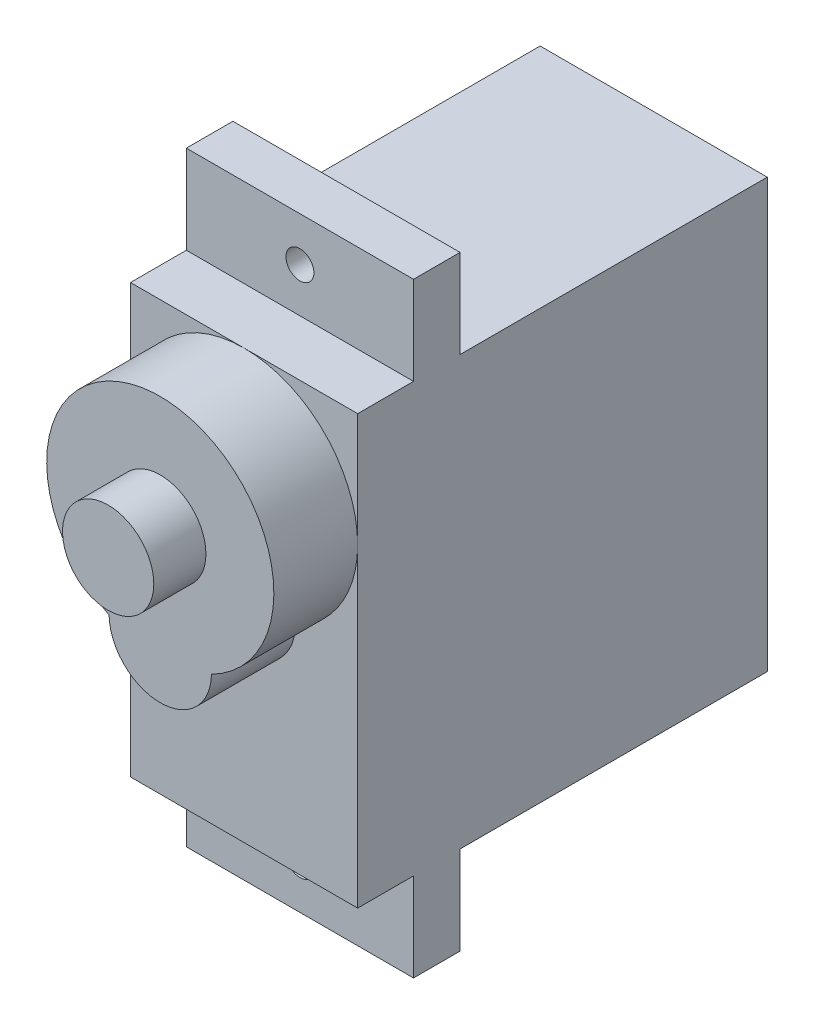
ISO-10303-21;
HEADER;
FILE_DESCRIPTION(('STEP AP214'),'2;1');
FILE_NAME('part.step','',(''),(''),'','','');
FILE_SCHEMA(('AUTOMOTIVE_DESIGN { 1 0 10303 214 1 1 1 1 }'));
ENDSEC;
DATA;
#1=APPLICATION_CONTEXT('core data for automotive mechanical design processes');
#2=APPLICATION_PROTOCOL_DEFINITION('international standard','automotive_design',2000,#1);
#3=PRODUCT_CONTEXT('',#1,'mechanical');
#4=PRODUCT('Part','Part','',(#3));
#5=PRODUCT_RELATED_PRODUCT_CATEGORY('part','',(#4));
#6=PRODUCT_DEFINITION_FORMATION('','',#4);
#7=PRODUCT_DEFINITION_CONTEXT('part definition',#1,'design');
#8=PRODUCT_DEFINITION('design','',#6,#7);
#9=PRODUCT_DEFINITION_SHAPE('','',#8);
#10=(LENGTH_UNIT() NAMED_UNIT(*) SI_UNIT(.MILLI.,.METRE.));
#11=(NAMED_UNIT(*) PLANE_ANGLE_UNIT() SI_UNIT($,.RADIAN.));
#12=(NAMED_UNIT(*) SI_UNIT($,.STERADIAN.) SOLID_ANGLE_UNIT());
#13=UNCERTAINTY_MEASURE_WITH_UNIT(LENGTH_MEASURE(1.E-05),#10,'distance_accuracy_value','');
#14=(GEOMETRIC_REPRESENTATION_CONTEXT(3) GLOBAL_UNCERTAINTY_ASSIGNED_CONTEXT((#13)) GLOBAL_UNIT_ASSIGNED_CONTEXT((#10,
#11,#12)) REPRESENTATION_CONTEXT('',''));
#15=CARTESIAN_POINT('',(0.,0.,0.));
#16=DIRECTION('',(0.,0.,1.));
#17=DIRECTION('',(1.,0.,0.));
#18=AXIS2_PLACEMENT_3D('',#15,#16,#17);
#19=CARTESIAN_POINT('',(6.1,-11.5,-11.));
#20=DIRECTION('',(0.,1.,0.));
#21=DIRECTION('',(0.,0.,1.));
#22=AXIS2_PLACEMENT_3D('',#19,#20,#21);
#23=PLANE('',#22);
#24=DIRECTION('',(-1.,0.,0.));
#25=VECTOR('',#24,1.);
#26=CARTESIAN_POINT('',(6.1,-11.5,8.));
#27=LINE('',#26,#25);
#28=CARTESIAN_POINT('',(6.1,-11.5,8.));
#29=VERTEX_POINT('',#28);
#30=CARTESIAN_POINT('',(-6.1,-11.5,8.));
#31=VERTEX_POINT('',#30);
#32=EDGE_CURVE('E322',#29,#31,#27,.T.);
#33=ORIENTED_EDGE('',*,*,#32,.F.);
#34=DIRECTION('',(0.,0.,-1.));
#35=VECTOR('',#34,1.);
#36=CARTESIAN_POINT('',(6.1,-11.5,-11.));
#37=LINE('',#36,#35);
#38=CARTESIAN_POINT('',(6.1,-11.5,11.));
#39=VERTEX_POINT('',#38);
#40=EDGE_CURVE('E165',#39,#29,#37,.T.);
#41=ORIENTED_EDGE('',*,*,#40,.F.);
#42=DIRECTION('',(-1.,0.,0.));
#43=VECTOR('',#42,1.);
#44=CARTESIAN_POINT('',(6.1,-11.5,11.));
#45=LINE('',#44,#43);
#46=CARTESIAN_POINT('',(-6.1,-11.5,11.));
#47=VERTEX_POINT('',#46);
#48=EDGE_CURVE('E38',#39,#47,#45,.T.);
#49=ORIENTED_EDGE('',*,*,#48,.T.);
#50=DIRECTION('',(0.,0.,-1.));
#51=VECTOR('',#50,1.);
#52=CARTESIAN_POINT('',(-6.1,-11.5,-11.));
#53=LINE('',#52,#51);
#54=EDGE_CURVE('E238',#47,#31,#53,.T.);
#55=ORIENTED_EDGE('',*,*,#54,.T.);
#56=EDGE_LOOP('',(#33,#41,#49,#55));
#57=FACE_BOUND('',#56,.T.);
#58=ADVANCED_FACE('F34',(#57),#23,.F.);
#59=CARTESIAN_POINT('',(6.1,11.5,-11.));
#60=DIRECTION('',(0.,-1.,0.));
#61=DIRECTION('',(0.,0.,-1.));
#62=AXIS2_PLACEMENT_3D('',#59,#60,#61);
#63=PLANE('',#62);
#64=DIRECTION('',(-1.,0.,0.));
#65=VECTOR('',#64,1.);
#66=CARTESIAN_POINT('',(6.1,11.5,8.));
#67=LINE('',#66,#65);
#68=CARTESIAN_POINT('',(6.1,11.5,8.));
#69=VERTEX_POINT('',#68);
#70=CARTESIAN_POINT('',(-6.1,11.5,8.));
#71=VERTEX_POINT('',#70);
#72=EDGE_CURVE('E199',#69,#71,#67,.T.);
#73=ORIENTED_EDGE('',*,*,#72,.T.);
#74=DIRECTION('',(0.,0.,1.));
#75=VECTOR('',#74,1.);
#76=CARTESIAN_POINT('',(-6.1,11.5,-11.));
#77=LINE('',#76,#75);
#78=CARTESIAN_POINT('',(-6.1,11.5,11.));
#79=VERTEX_POINT('',#78);
#80=EDGE_CURVE('E243',#71,#79,#77,.T.);
#81=ORIENTED_EDGE('',*,*,#80,.T.);
#82=DIRECTION('',(-1.,0.,0.));
#83=VECTOR('',#82,1.);
#84=CARTESIAN_POINT('',(6.1,11.5,11.));
#85=LINE('',#84,#83);
#86=CARTESIAN_POINT('',(0.,11.5,11.));
#87=VERTEX_POINT('',#86);
#88=EDGE_CURVE('E233',#87,#79,#85,.T.);
#89=ORIENTED_EDGE('',*,*,#88,.F.);
#90=CARTESIAN_POINT('',(6.1,11.5,11.));
#91=VERTEX_POINT('',#90);
#92=EDGE_CURVE('E246',#91,#87,#85,.T.);
#93=ORIENTED_EDGE('',*,*,#92,.F.);
#94=DIRECTION('',(0.,0.,1.));
#95=VECTOR('',#94,1.);
#96=CARTESIAN_POINT('',(6.1,11.5,-11.));
#97=LINE('',#96,#95);
#98=EDGE_CURVE('E59',#69,#91,#97,.T.);
#99=ORIENTED_EDGE('',*,*,#98,.F.);
#100=EDGE_LOOP('',(#73,#81,#89,#93,#99));
#101=FACE_BOUND('',#100,.T.);
#102=ADVANCED_FACE('F276',(#101),#63,.F.);
#103=DIRECTION('',(-1.,0.,0.));
#104=VECTOR('',#103,1.);
#105=CARTESIAN_POINT('',(6.1,11.5,5.5));
#106=LINE('',#105,#104);
#107=CARTESIAN_POINT('',(6.1,11.5,5.5));
#108=VERTEX_POINT('',#107);
#109=CARTESIAN_POINT('',(-6.1,11.5,5.5));
#110=VERTEX_POINT('',#109);
#111=EDGE_CURVE('E196',#108,#110,#106,.T.);
#112=ORIENTED_EDGE('',*,*,#111,.F.);
#113=CARTESIAN_POINT('',(6.1,11.5,-11.));
#114=VERTEX_POINT('',#113);
#115=EDGE_CURVE('E230',#114,#108,#97,.T.);
#116=ORIENTED_EDGE('',*,*,#115,.F.);
#117=DIRECTION('',(-1.,0.,0.));
#118=VECTOR('',#117,1.);
#119=CARTESIAN_POINT('',(6.1,11.5,-11.));
#120=LINE('',#119,#118);
#121=CARTESIAN_POINT('',(-6.1,11.5,-11.));
#122=VERTEX_POINT('',#121);
#123=EDGE_CURVE('E249',#114,#122,#120,.T.);
#124=ORIENTED_EDGE('',*,*,#123,.T.);
#125=EDGE_CURVE('E244',#122,#110,#77,.T.);
#126=ORIENTED_EDGE('',*,*,#125,.T.);
#127=EDGE_LOOP('',(#112,#116,#124,#126));
#128=FACE_BOUND('',#127,.T.);
#129=ADVANCED_FACE('F309',(#128),#63,.F.);
#130=CARTESIAN_POINT('',(6.1,-11.5,11.));
#131=DIRECTION('',(0.,0.,-1.));
#132=DIRECTION('',(-1.,0.,0.));
#133=AXIS2_PLACEMENT_3D('',#130,#131,#132);
#134=PLANE('',#133);
#135=CARTESIAN_POINT('',(0.,0.,11.));
#136=DIRECTION('',(0.,0.,1.));
#137=DIRECTION('',(1.,0.,0.));
#138=AXIS2_PLACEMENT_3D('',#135,#136,#137);
#139=CIRCLE('',#138,2.75);
#140=CARTESIAN_POINT('',(-2.74962951699132,-0.0451388888888871,11.));
#141=VERTEX_POINT('',#140);
#142=CARTESIAN_POINT('',(2.74962951699131,-0.0451388888888906,11.));
#143=VERTEX_POINT('',#142);
#144=EDGE_CURVE('E203',#141,#143,#139,.T.);
#145=ORIENTED_EDGE('',*,*,#144,.F.);
#146=CARTESIAN_POINT('',(0.,5.4,11.));
#147=DIRECTION('',(0.,0.,1.));
#148=DIRECTION('',(1.,0.,0.));
#149=AXIS2_PLACEMENT_3D('',#146,#147,#148);
#150=CIRCLE('',#149,6.1);
#151=CARTESIAN_POINT('',(-6.1,5.4,11.));
#152=VERTEX_POINT('',#151);
#153=EDGE_CURVE('E216',#152,#141,#150,.T.);
#154=ORIENTED_EDGE('',*,*,#153,.F.);
#155=DIRECTION('',(0.,-1.,0.));
#156=VECTOR('',#155,1.);
#157=CARTESIAN_POINT('',(-6.1,-11.5,11.));
#158=LINE('',#157,#156);
#159=EDGE_CURVE('E222',#152,#47,#158,.T.);
#160=ORIENTED_EDGE('',*,*,#159,.T.);
#161=ORIENTED_EDGE('',*,*,#48,.F.);
#162=DIRECTION('',(0.,-1.,0.));
#163=VECTOR('',#162,1.);
#164=CARTESIAN_POINT('',(6.1,-11.5,11.));
#165=LINE('',#164,#163);
#166=CARTESIAN_POINT('',(6.1,5.4,11.));
#167=VERTEX_POINT('',#166);
#168=EDGE_CURVE('E226',#167,#39,#165,.T.);
#169=ORIENTED_EDGE('',*,*,#168,.F.);
#170=EDGE_CURVE('E209',#143,#167,#150,.T.);
#171=ORIENTED_EDGE('',*,*,#170,.F.);
#172=EDGE_LOOP('',(#145,#154,#160,#161,#169,#171));
#173=FACE_BOUND('',#172,.T.);
#174=ADVANCED_FACE('F272',(#173),#134,.F.);
#175=EDGE_CURVE('E43',#167,#87,#150,.T.);
#176=ORIENTED_EDGE('',*,*,#175,.F.);
#177=EDGE_CURVE('E223',#91,#167,#165,.T.);
#178=ORIENTED_EDGE('',*,*,#177,.F.);
#179=ORIENTED_EDGE('',*,*,#92,.T.);
#180=EDGE_LOOP('',(#176,#178,#179));
#181=FACE_BOUND('',#180,.T.);
#182=ADVANCED_FACE('F270',(#181),#134,.F.);
#183=EDGE_CURVE('E261',#87,#152,#150,.T.);
#184=ORIENTED_EDGE('',*,*,#183,.F.);
#185=ORIENTED_EDGE('',*,*,#88,.T.);
#186=EDGE_CURVE('E234',#79,#152,#158,.T.);
#187=ORIENTED_EDGE('',*,*,#186,.T.);
#188=EDGE_LOOP('',(#184,#185,#187));
#189=FACE_BOUND('',#188,.T.);
#190=ADVANCED_FACE('F36',(#189),#134,.F.);
#191=CARTESIAN_POINT('',(6.1,-11.5,5.5));
#192=VERTEX_POINT('',#191);
#193=CARTESIAN_POINT('',(6.1,-11.5,-11.));
#194=VERTEX_POINT('',#193);
#195=EDGE_CURVE('E225',#192,#194,#37,.T.);
#196=ORIENTED_EDGE('',*,*,#195,.F.);
#197=DIRECTION('',(-1.,0.,0.));
#198=VECTOR('',#197,1.);
#199=CARTESIAN_POINT('',(6.1,-11.5,5.5));
#200=LINE('',#199,#198);
#201=CARTESIAN_POINT('',(-6.1,-11.5,5.5));
#202=VERTEX_POINT('',#201);
#203=EDGE_CURVE('E177',#192,#202,#200,.T.);
#204=ORIENTED_EDGE('',*,*,#203,.T.);
#205=CARTESIAN_POINT('',(-6.1,-11.5,-11.));
#206=VERTEX_POINT('',#205);
#207=EDGE_CURVE('E237',#202,#206,#53,.T.);
#208=ORIENTED_EDGE('',*,*,#207,.T.);
#209=DIRECTION('',(-1.,0.,0.));
#210=VECTOR('',#209,1.);
#211=CARTESIAN_POINT('',(6.1,-11.5,-11.));
#212=LINE('',#211,#210);
#213=EDGE_CURVE('E251',#194,#206,#212,.T.);
#214=ORIENTED_EDGE('',*,*,#213,.F.);
#215=EDGE_LOOP('',(#196,#204,#208,#214));
#216=FACE_BOUND('',#215,.T.);
#217=ADVANCED_FACE('F305',(#216),#23,.F.);
#218=CARTESIAN_POINT('',(6.1,-11.5,-11.));
#219=DIRECTION('',(0.,0.,1.));
#220=DIRECTION('',(1.,0.,0.));
#221=AXIS2_PLACEMENT_3D('',#218,#219,#220);
#222=PLANE('',#221);
#223=DIRECTION('',(0.,1.,0.));
#224=VECTOR('',#223,1.);
#225=CARTESIAN_POINT('',(-6.1,-11.5,-11.));
#226=LINE('',#225,#224);
#227=EDGE_CURVE('E241',#206,#122,#226,.T.);
#228=ORIENTED_EDGE('',*,*,#227,.T.);
#229=ORIENTED_EDGE('',*,*,#123,.F.);
#230=DIRECTION('',(0.,1.,0.));
#231=VECTOR('',#230,1.);
#232=CARTESIAN_POINT('',(6.1,-11.5,-11.));
#233=LINE('',#232,#231);
#234=EDGE_CURVE('E228',#194,#114,#233,.T.);
#235=ORIENTED_EDGE('',*,*,#234,.F.);
#236=ORIENTED_EDGE('',*,*,#213,.T.);
#237=EDGE_LOOP('',(#228,#229,#235,#236));
#238=FACE_BOUND('',#237,.T.);
#239=ADVANCED_FACE('F313',(#238),#222,.F.);
#240=CARTESIAN_POINT('',(6.1,0.,0.));
#241=DIRECTION('',(1.,0.,0.));
#242=DIRECTION('',(0.,0.,-1.));
#243=AXIS2_PLACEMENT_3D('',#240,#241,#242);
#244=PLANE('',#243);
#245=ORIENTED_EDGE('',*,*,#177,.T.);
#246=ORIENTED_EDGE('',*,*,#168,.T.);
#247=ORIENTED_EDGE('',*,*,#40,.T.);
#248=DIRECTION('',(0.,-1.,0.));
#249=VECTOR('',#248,1.);
#250=CARTESIAN_POINT('',(6.1,-11.5,8.));
#251=LINE('',#250,#249);
#252=CARTESIAN_POINT('',(6.1,-16.25,8.));
#253=VERTEX_POINT('',#252);
#254=EDGE_CURVE('E159',#29,#253,#251,.T.);
#255=ORIENTED_EDGE('',*,*,#254,.T.);
#256=DIRECTION('',(0.,0.,-1.));
#257=VECTOR('',#256,1.);
#258=CARTESIAN_POINT('',(6.1,-16.25,8.));
#259=LINE('',#258,#257);
#260=CARTESIAN_POINT('',(6.1,-16.25,5.5));
#261=VERTEX_POINT('',#260);
#262=EDGE_CURVE('E149',#253,#261,#259,.T.);
#263=ORIENTED_EDGE('',*,*,#262,.T.);
#264=DIRECTION('',(0.,1.,0.));
#265=VECTOR('',#264,1.);
#266=CARTESIAN_POINT('',(6.1,-11.5,5.5));
#267=LINE('',#266,#265);
#268=EDGE_CURVE('E158',#261,#192,#267,.T.);
#269=ORIENTED_EDGE('',*,*,#268,.T.);
#270=ORIENTED_EDGE('',*,*,#195,.T.);
#271=ORIENTED_EDGE('',*,*,#234,.T.);
#272=ORIENTED_EDGE('',*,*,#115,.T.);
#273=DIRECTION('',(0.,1.,0.));
#274=VECTOR('',#273,1.);
#275=CARTESIAN_POINT('',(6.1,11.5,5.5));
#276=LINE('',#275,#274);
#277=CARTESIAN_POINT('',(6.1,16.25,5.5));
#278=VERTEX_POINT('',#277);
#279=EDGE_CURVE('E183',#108,#278,#276,.T.);
#280=ORIENTED_EDGE('',*,*,#279,.T.);
#281=DIRECTION('',(0.,0.,1.));
#282=VECTOR('',#281,1.);
#283=CARTESIAN_POINT('',(6.1,16.25,8.));
#284=LINE('',#283,#282);
#285=CARTESIAN_POINT('',(6.1,16.25,8.));
#286=VERTEX_POINT('',#285);
#287=EDGE_CURVE('E186',#278,#286,#284,.T.);
#288=ORIENTED_EDGE('',*,*,#287,.T.);
#289=DIRECTION('',(0.,-1.,0.));
#290=VECTOR('',#289,1.);
#291=CARTESIAN_POINT('',(6.1,11.5,8.));
#292=LINE('',#291,#290);
#293=EDGE_CURVE('E181',#286,#69,#292,.T.);
#294=ORIENTED_EDGE('',*,*,#293,.T.);
#295=ORIENTED_EDGE('',*,*,#98,.T.);
#296=EDGE_LOOP('',(#245,#246,#247,#255,#263,#269,#270,#271,#272,#280,#288,#294,#295));
#297=FACE_BOUND('',#296,.T.);
#298=ADVANCED_FACE('F163',(#297),#244,.T.);
#299=CARTESIAN_POINT('',(-6.1,0.,0.));
#300=DIRECTION('',(1.,0.,0.));
#301=DIRECTION('',(0.,0.,-1.));
#302=AXIS2_PLACEMENT_3D('',#299,#300,#301);
#303=PLANE('',#302);
#304=ORIENTED_EDGE('',*,*,#186,.F.);
#305=ORIENTED_EDGE('',*,*,#80,.F.);
#306=DIRECTION('',(0.,-1.,0.));
#307=VECTOR('',#306,1.);
#308=CARTESIAN_POINT('',(-6.1,11.5,8.));
#309=LINE('',#308,#307);
#310=CARTESIAN_POINT('',(-6.1,16.25,8.));
#311=VERTEX_POINT('',#310);
#312=EDGE_CURVE('E172',#311,#71,#309,.T.);
#313=ORIENTED_EDGE('',*,*,#312,.F.);
#314=DIRECTION('',(0.,0.,1.));
#315=VECTOR('',#314,1.);
#316=CARTESIAN_POINT('',(-6.1,16.25,8.));
#317=LINE('',#316,#315);
#318=CARTESIAN_POINT('',(-6.1,16.25,5.5));
#319=VERTEX_POINT('',#318);
#320=EDGE_CURVE('E184',#319,#311,#317,.T.);
#321=ORIENTED_EDGE('',*,*,#320,.F.);
#322=DIRECTION('',(0.,1.,0.));
#323=VECTOR('',#322,1.);
#324=CARTESIAN_POINT('',(-6.1,11.5,5.5));
#325=LINE('',#324,#323);
#326=EDGE_CURVE('E175',#110,#319,#325,.T.);
#327=ORIENTED_EDGE('',*,*,#326,.F.);
#328=ORIENTED_EDGE('',*,*,#125,.F.);
#329=ORIENTED_EDGE('',*,*,#227,.F.);
#330=ORIENTED_EDGE('',*,*,#207,.F.);
#331=DIRECTION('',(0.,1.,0.));
#332=VECTOR('',#331,1.);
#333=CARTESIAN_POINT('',(-6.1,-11.5,5.5));
#334=LINE('',#333,#332);
#335=CARTESIAN_POINT('',(-6.1,-16.25,5.5));
#336=VERTEX_POINT('',#335);
#337=EDGE_CURVE('E51',#336,#202,#334,.T.);
#338=ORIENTED_EDGE('',*,*,#337,.F.);
#339=DIRECTION('',(0.,0.,-1.));
#340=VECTOR('',#339,1.);
#341=CARTESIAN_POINT('',(-6.1,-16.25,8.));
#342=LINE('',#341,#340);
#343=CARTESIAN_POINT('',(-6.1,-16.25,8.));
#344=VERTEX_POINT('',#343);
#345=EDGE_CURVE('E328',#344,#336,#342,.T.);
#346=ORIENTED_EDGE('',*,*,#345,.F.);
#347=DIRECTION('',(0.,-1.,0.));
#348=VECTOR('',#347,1.);
#349=CARTESIAN_POINT('',(-6.1,-11.5,8.));
#350=LINE('',#349,#348);
#351=EDGE_CURVE('E171',#31,#344,#350,.T.);
#352=ORIENTED_EDGE('',*,*,#351,.F.);
#353=ORIENTED_EDGE('',*,*,#54,.F.);
#354=ORIENTED_EDGE('',*,*,#159,.F.);
#355=EDGE_LOOP('',(#304,#305,#313,#321,#327,#328,#329,#330,#338,#346,#352,#353,#354));
#356=FACE_BOUND('',#355,.T.);
#357=ADVANCED_FACE('F282',(#356),#303,.F.);
#358=CARTESIAN_POINT('',(0.,0.,15.5));
#359=DIRECTION('',(0.,0.,-1.));
#360=DIRECTION('',(-1.,0.,0.));
#361=AXIS2_PLACEMENT_3D('',#358,#359,#360);
#362=CYLINDRICAL_SURFACE('',#361,2.75);
#363=ORIENTED_EDGE('',*,*,#144,.T.);
#364=DIRECTION('',(0.,0.,-1.));
#365=VECTOR('',#364,1.);
#366=CARTESIAN_POINT('',(2.74962951699131,-0.0451388888888906,15.5));
#367=LINE('',#366,#365);
#368=CARTESIAN_POINT('',(2.74962951699131,-0.0451388888888906,15.5));
#369=VERTEX_POINT('',#368);
#370=EDGE_CURVE('E219',#369,#143,#367,.T.);
#371=ORIENTED_EDGE('',*,*,#370,.F.);
#372=CARTESIAN_POINT('',(0.,0.,15.5));
#373=DIRECTION('',(0.,0.,1.));
#374=DIRECTION('',(1.,0.,0.));
#375=AXIS2_PLACEMENT_3D('',#372,#373,#374);
#376=CIRCLE('',#375,2.75);
#377=CARTESIAN_POINT('',(-2.74962951699132,-0.0451388888888871,15.5));
#378=VERTEX_POINT('',#377);
#379=EDGE_CURVE('E205',#378,#369,#376,.T.);
#380=ORIENTED_EDGE('',*,*,#379,.F.);
#381=DIRECTION('',(0.,0.,-1.));
#382=VECTOR('',#381,1.);
#383=CARTESIAN_POINT('',(-2.74962951699132,-0.0451388888888871,15.5));
#384=LINE('',#383,#382);
#385=EDGE_CURVE('E211',#378,#141,#384,.T.);
#386=ORIENTED_EDGE('',*,*,#385,.T.);
#387=EDGE_LOOP('',(#363,#371,#380,#386));
#388=FACE_BOUND('',#387,.T.);
#389=ADVANCED_FACE('F287',(#388),#362,.T.);
#390=CARTESIAN_POINT('',(0.,5.4,15.5));
#391=DIRECTION('',(0.,0.,-1.));
#392=DIRECTION('',(-1.,0.,0.));
#393=AXIS2_PLACEMENT_3D('',#390,#391,#392);
#394=CYLINDRICAL_SURFACE('',#393,6.1);
#395=ORIENTED_EDGE('',*,*,#170,.T.);
#396=ORIENTED_EDGE('',*,*,#175,.T.);
#397=ORIENTED_EDGE('',*,*,#183,.T.);
#398=ORIENTED_EDGE('',*,*,#153,.T.);
#399=ORIENTED_EDGE('',*,*,#385,.F.);
#400=CARTESIAN_POINT('',(0.,5.4,15.5));
#401=DIRECTION('',(0.,0.,1.));
#402=DIRECTION('',(1.,0.,0.));
#403=AXIS2_PLACEMENT_3D('',#400,#401,#402);
#404=CIRCLE('',#403,6.1);
#405=EDGE_CURVE('E208',#369,#378,#404,.T.);
#406=ORIENTED_EDGE('',*,*,#405,.F.);
#407=ORIENTED_EDGE('',*,*,#370,.T.);
#408=EDGE_LOOP('',(#395,#396,#397,#398,#399,#406,#407));
#409=FACE_BOUND('',#408,.T.);
#410=ADVANCED_FACE('F266',(#409),#394,.T.);
#411=CARTESIAN_POINT('',(0.,2.7,15.5));
#412=DIRECTION('',(0.,0.,1.));
#413=DIRECTION('',(1.,0.,0.));
#414=AXIS2_PLACEMENT_3D('',#411,#412,#413);
#415=PLANE('',#414);
#416=CARTESIAN_POINT('',(0.,5.4,15.5));
#417=DIRECTION('',(0.,0.,1.));
#418=DIRECTION('',(1.,0.,0.));
#419=AXIS2_PLACEMENT_3D('',#416,#417,#418);
#420=CIRCLE('',#419,2.45);
#421=CARTESIAN_POINT('',(2.45,5.4,15.5));
#422=VERTEX_POINT('',#421);
#423=EDGE_CURVE('E11',#422,#422,#420,.T.);
#424=ORIENTED_EDGE('',*,*,#423,.F.);
#425=EDGE_LOOP('',(#424));
#426=FACE_BOUND('',#425,.T.);
#427=ORIENTED_EDGE('',*,*,#379,.T.);
#428=ORIENTED_EDGE('',*,*,#405,.T.);
#429=EDGE_LOOP('',(#427,#428));
#430=FACE_BOUND('',#429,.T.);
#431=ADVANCED_FACE('F290',(#426,#430),#415,.T.);
#432=CARTESIAN_POINT('',(0.,5.4,18.3));
#433=DIRECTION('',(0.,0.,-1.));
#434=DIRECTION('',(-1.,0.,0.));
#435=AXIS2_PLACEMENT_3D('',#432,#433,#434);
#436=CYLINDRICAL_SURFACE('',#435,2.45);
#437=CARTESIAN_POINT('',(0.,5.4,18.3));
#438=DIRECTION('',(0.,0.,1.));
#439=DIRECTION('',(1.,0.,0.));
#440=AXIS2_PLACEMENT_3D('',#437,#438,#439);
#441=CIRCLE('',#440,2.45);
#442=CARTESIAN_POINT('',(2.45,5.4,18.3));
#443=VERTEX_POINT('',#442);
#444=EDGE_CURVE('E201',#443,#443,#441,.T.);
#445=ORIENTED_EDGE('',*,*,#444,.F.);
#446=EDGE_LOOP('',(#445));
#447=FACE_BOUND('',#446,.T.);
#448=ORIENTED_EDGE('',*,*,#423,.T.);
#449=EDGE_LOOP('',(#448));
#450=FACE_BOUND('',#449,.T.);
#451=ADVANCED_FACE('F292',(#447,#450),#436,.T.);
#452=CARTESIAN_POINT('',(0.,5.4,18.3));
#453=DIRECTION('',(0.,0.,1.));
#454=DIRECTION('',(1.,0.,0.));
#455=AXIS2_PLACEMENT_3D('',#452,#453,#454);
#456=PLANE('',#455);
#457=ORIENTED_EDGE('',*,*,#444,.T.);
#458=EDGE_LOOP('',(#457));
#459=FACE_BOUND('',#458,.T.);
#460=ADVANCED_FACE('F299',(#459),#456,.T.);
#461=CARTESIAN_POINT('',(6.1,11.5,8.));
#462=DIRECTION('',(0.,0.,-1.));
#463=DIRECTION('',(-1.,0.,0.));
#464=AXIS2_PLACEMENT_3D('',#461,#462,#463);
#465=PLANE('',#464);
#466=CARTESIAN_POINT('',(0.,13.875,8.));
#467=DIRECTION('',(0.,0.,1.));
#468=DIRECTION('',(1.,0.,0.));
#469=AXIS2_PLACEMENT_3D('',#466,#467,#468);
#470=CIRCLE('',#469,0.75);
#471=CARTESIAN_POINT('',(0.75,13.875,8.));
#472=VERTEX_POINT('',#471);
#473=EDGE_CURVE('E335',#472,#472,#470,.T.);
#474=ORIENTED_EDGE('',*,*,#473,.F.);
#475=EDGE_LOOP('',(#474));
#476=FACE_BOUND('',#475,.T.);
#477=ORIENTED_EDGE('',*,*,#312,.T.);
#478=ORIENTED_EDGE('',*,*,#72,.F.);
#479=ORIENTED_EDGE('',*,*,#293,.F.);
#480=DIRECTION('',(-1.,0.,0.));
#481=VECTOR('',#480,1.);
#482=CARTESIAN_POINT('',(6.1,16.25,8.));
#483=LINE('',#482,#481);
#484=EDGE_CURVE('E187',#286,#311,#483,.T.);
#485=ORIENTED_EDGE('',*,*,#484,.T.);
#486=EDGE_LOOP('',(#477,#478,#479,#485));
#487=FACE_BOUND('',#486,.T.);
#488=ADVANCED_FACE('F347',(#476,#487),#465,.F.);
#489=CARTESIAN_POINT('',(6.1,11.5,5.5));
#490=DIRECTION('',(0.,0.,1.));
#491=DIRECTION('',(1.,0.,0.));
#492=AXIS2_PLACEMENT_3D('',#489,#490,#491);
#493=PLANE('',#492);
#494=CARTESIAN_POINT('',(0.,13.875,5.5));
#495=DIRECTION('',(0.,0.,1.));
#496=DIRECTION('',(1.,0.,0.));
#497=AXIS2_PLACEMENT_3D('',#494,#495,#496);
#498=CIRCLE('',#497,0.75);
#499=CARTESIAN_POINT('',(0.75,13.875,5.5));
#500=VERTEX_POINT('',#499);
#501=EDGE_CURVE('E330',#500,#500,#498,.F.);
#502=ORIENTED_EDGE('',*,*,#501,.F.);
#503=EDGE_LOOP('',(#502));
#504=FACE_BOUND('',#503,.T.);
#505=ORIENTED_EDGE('',*,*,#326,.T.);
#506=DIRECTION('',(-1.,0.,0.));
#507=VECTOR('',#506,1.);
#508=CARTESIAN_POINT('',(6.1,16.25,5.5));
#509=LINE('',#508,#507);
#510=EDGE_CURVE('E193',#278,#319,#509,.T.);
#511=ORIENTED_EDGE('',*,*,#510,.F.);
#512=ORIENTED_EDGE('',*,*,#279,.F.);
#513=ORIENTED_EDGE('',*,*,#111,.T.);
#514=EDGE_LOOP('',(#505,#511,#512,#513));
#515=FACE_BOUND('',#514,.T.);
#516=ADVANCED_FACE('F350',(#504,#515),#493,.F.);
#517=CARTESIAN_POINT('',(6.1,16.25,8.));
#518=DIRECTION('',(0.,-1.,0.));
#519=DIRECTION('',(0.,0.,-1.));
#520=AXIS2_PLACEMENT_3D('',#517,#518,#519);
#521=PLANE('',#520);
#522=ORIENTED_EDGE('',*,*,#320,.T.);
#523=ORIENTED_EDGE('',*,*,#484,.F.);
#524=ORIENTED_EDGE('',*,*,#287,.F.);
#525=ORIENTED_EDGE('',*,*,#510,.T.);
#526=EDGE_LOOP('',(#522,#523,#524,#525));
#527=FACE_BOUND('',#526,.T.);
#528=ADVANCED_FACE('F357',(#527),#521,.F.);
#529=CARTESIAN_POINT('',(6.1,-11.5,8.));
#530=DIRECTION('',(0.,0.,-1.));
#531=DIRECTION('',(-1.,0.,0.));
#532=AXIS2_PLACEMENT_3D('',#529,#530,#531);
#533=PLANE('',#532);
#534=CARTESIAN_POINT('',(0.,-13.875,8.));
#535=DIRECTION('',(0.,0.,1.));
#536=DIRECTION('',(1.,0.,0.));
#537=AXIS2_PLACEMENT_3D('',#534,#535,#536);
#538=CIRCLE('',#537,0.75);
#539=CARTESIAN_POINT('',(0.75,-13.875,8.));
#540=VERTEX_POINT('',#539);
#541=EDGE_CURVE('E336',#540,#540,#538,.T.);
#542=ORIENTED_EDGE('',*,*,#541,.F.);
#543=EDGE_LOOP('',(#542));
#544=FACE_BOUND('',#543,.T.);
#545=ORIENTED_EDGE('',*,*,#351,.T.);
#546=DIRECTION('',(-1.,0.,0.));
#547=VECTOR('',#546,1.);
#548=CARTESIAN_POINT('',(6.1,-16.25,8.));
#549=LINE('',#548,#547);
#550=EDGE_CURVE('E153',#253,#344,#549,.T.);
#551=ORIENTED_EDGE('',*,*,#550,.F.);
#552=ORIENTED_EDGE('',*,*,#254,.F.);
#553=ORIENTED_EDGE('',*,*,#32,.T.);
#554=EDGE_LOOP('',(#545,#551,#552,#553));
#555=FACE_BOUND('',#554,.T.);
#556=ADVANCED_FACE('F169',(#544,#555),#533,.F.);
#557=CARTESIAN_POINT('',(6.1,-16.25,8.));
#558=DIRECTION('',(0.,1.,0.));
#559=DIRECTION('',(0.,0.,1.));
#560=AXIS2_PLACEMENT_3D('',#557,#558,#559);
#561=PLANE('',#560);
#562=ORIENTED_EDGE('',*,*,#345,.T.);
#563=DIRECTION('',(-1.,0.,0.));
#564=VECTOR('',#563,1.);
#565=CARTESIAN_POINT('',(6.1,-16.25,5.5));
#566=LINE('',#565,#564);
#567=EDGE_CURVE('E155',#261,#336,#566,.T.);
#568=ORIENTED_EDGE('',*,*,#567,.F.);
#569=ORIENTED_EDGE('',*,*,#262,.F.);
#570=ORIENTED_EDGE('',*,*,#550,.T.);
#571=EDGE_LOOP('',(#562,#568,#569,#570));
#572=FACE_BOUND('',#571,.T.);
#573=ADVANCED_FACE('F151',(#572),#561,.F.);
#574=CARTESIAN_POINT('',(6.1,-11.5,5.5));
#575=DIRECTION('',(0.,0.,1.));
#576=DIRECTION('',(0.,-1.,0.));
#577=AXIS2_PLACEMENT_3D('',#574,#575,#576);
#578=PLANE('',#577);
#579=CARTESIAN_POINT('',(0.,-13.875,5.5));
#580=DIRECTION('',(0.,0.,1.));
#581=DIRECTION('',(0.,-1.,0.));
#582=AXIS2_PLACEMENT_3D('',#579,#580,#581);
#583=CIRCLE('',#582,0.75);
#584=CARTESIAN_POINT('',(0.,-14.625,5.5));
#585=VERTEX_POINT('',#584);
#586=EDGE_CURVE('E332',#585,#585,#583,.F.);
#587=ORIENTED_EDGE('',*,*,#586,.F.);
#588=EDGE_LOOP('',(#587));
#589=FACE_BOUND('',#588,.T.);
#590=ORIENTED_EDGE('',*,*,#337,.T.);
#591=ORIENTED_EDGE('',*,*,#203,.F.);
#592=ORIENTED_EDGE('',*,*,#268,.F.);
#593=ORIENTED_EDGE('',*,*,#567,.T.);
#594=EDGE_LOOP('',(#590,#591,#592,#593));
#595=FACE_BOUND('',#594,.T.);
#596=ADVANCED_FACE('F324',(#589,#595),#578,.F.);
#597=CARTESIAN_POINT('',(0.,-13.875,-11.001));
#598=DIRECTION('',(0.,0.,1.));
#599=DIRECTION('',(1.,0.,0.));
#600=AXIS2_PLACEMENT_3D('',#597,#598,#599);
#601=CYLINDRICAL_SURFACE('',#600,0.75);
#602=ORIENTED_EDGE('',*,*,#541,.T.);
#603=EDGE_LOOP('',(#602));
#604=FACE_BOUND('',#603,.T.);
#605=ORIENTED_EDGE('',*,*,#586,.T.);
#606=EDGE_LOOP('',(#605));
#607=FACE_BOUND('',#606,.T.);
#608=ADVANCED_FACE('F483',(#604,#607),#601,.F.);
#609=CARTESIAN_POINT('',(0.,13.875,-11.001));
#610=DIRECTION('',(0.,0.,1.));
#611=DIRECTION('',(1.,0.,0.));
#612=AXIS2_PLACEMENT_3D('',#609,#610,#611);
#613=CYLINDRICAL_SURFACE('',#612,0.75);
#614=ORIENTED_EDGE('',*,*,#473,.T.);
#615=EDGE_LOOP('',(#614));
#616=FACE_BOUND('',#615,.T.);
#617=ORIENTED_EDGE('',*,*,#501,.T.);
#618=EDGE_LOOP('',(#617));
#619=FACE_BOUND('',#618,.T.);
#620=ADVANCED_FACE('F344',(#616,#619),#613,.F.);
#621=CLOSED_SHELL('',(#58,#102,#129,#174,#182,#190,#217,#239,#298,#357,#389,#410,#431,#451,#460,
#488,#516,#528,#556,#573,#596,#608,#620));
#622=MANIFOLD_SOLID_BREP('B2',#621);
#623=ADVANCED_BREP_SHAPE_REPRESENTATION('',(#18,#622),#14);
#624=SHAPE_DEFINITION_REPRESENTATION(#9,#623);
ENDSEC;
END-ISO-10303-21;
